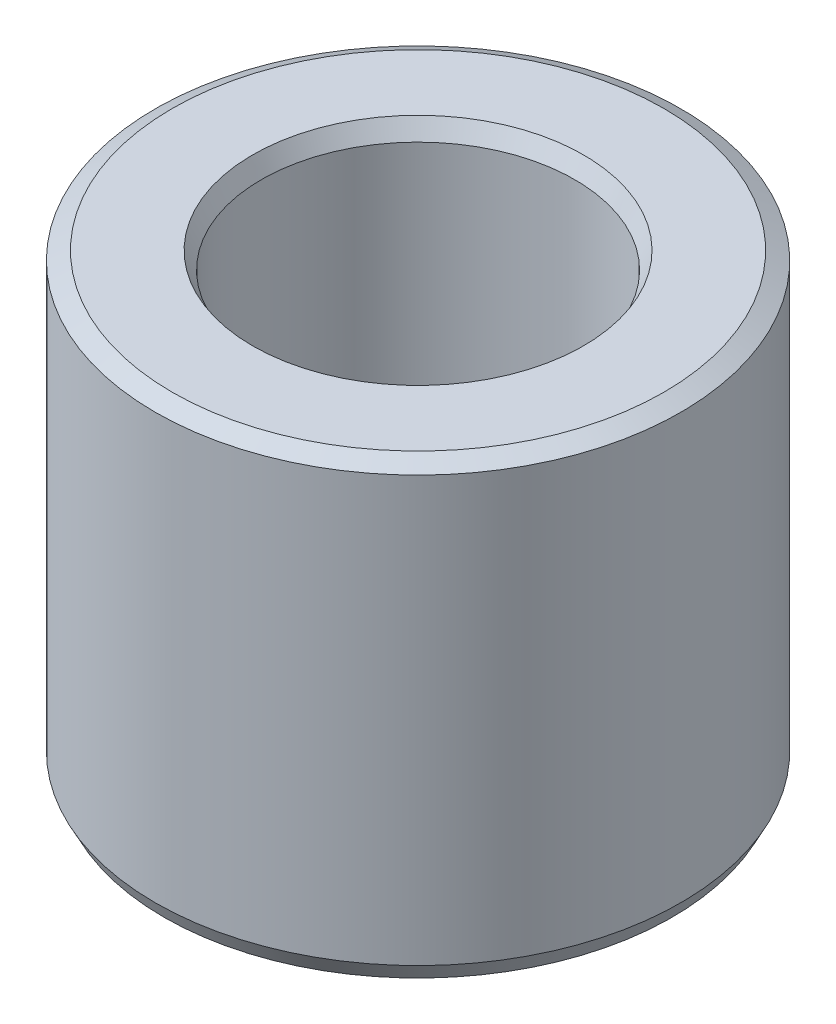
ISO-10303-21;
HEADER;
FILE_DESCRIPTION(('STEP AP214'),'2;1');
FILE_NAME('part.step','',(''),(''),'','','');
FILE_SCHEMA(('AUTOMOTIVE_DESIGN { 1 0 10303 214 1 1 1 1 }'));
ENDSEC;
DATA;
#1=APPLICATION_CONTEXT('core data for automotive mechanical design processes');
#2=APPLICATION_PROTOCOL_DEFINITION('international standard','automotive_design',2000,#1);
#3=PRODUCT_CONTEXT('',#1,'mechanical');
#4=PRODUCT('Part','Part','',(#3));
#5=PRODUCT_RELATED_PRODUCT_CATEGORY('part','',(#4));
#6=PRODUCT_DEFINITION_FORMATION('','',#4);
#7=PRODUCT_DEFINITION_CONTEXT('part definition',#1,'design');
#8=PRODUCT_DEFINITION('design','',#6,#7);
#9=PRODUCT_DEFINITION_SHAPE('','',#8);
#10=(LENGTH_UNIT() NAMED_UNIT(*) SI_UNIT(.MILLI.,.METRE.));
#11=(NAMED_UNIT(*) PLANE_ANGLE_UNIT() SI_UNIT($,.RADIAN.));
#12=(NAMED_UNIT(*) SI_UNIT($,.STERADIAN.) SOLID_ANGLE_UNIT());
#13=UNCERTAINTY_MEASURE_WITH_UNIT(LENGTH_MEASURE(1.E-05),#10,'distance_accuracy_value','');
#14=(GEOMETRIC_REPRESENTATION_CONTEXT(3) GLOBAL_UNCERTAINTY_ASSIGNED_CONTEXT((#13)) GLOBAL_UNIT_ASSIGNED_CONTEXT((#10,
#11,#12)) REPRESENTATION_CONTEXT('',''));
#15=CARTESIAN_POINT('',(0.,0.,0.));
#16=DIRECTION('',(0.,0.,1.));
#17=DIRECTION('',(1.,0.,0.));
#18=AXIS2_PLACEMENT_3D('',#15,#16,#17);
#19=CARTESIAN_POINT('',(0.,68.5759343217191,0.));
#20=DIRECTION('',(0.,-1.,0.));
#21=DIRECTION('',(0.,0.,-1.));
#22=AXIS2_PLACEMENT_3D('',#19,#20,#21);
#23=CYLINDRICAL_SURFACE('',#22,40.);
#24=CARTESIAN_POINT('',(0.,2.59032202311171,0.));
#25=DIRECTION('',(0.,1.,0.));
#26=DIRECTION('',(0.,0.,1.));
#27=AXIS2_PLACEMENT_3D('',#24,#25,#26);
#28=CIRCLE('',#27,40.);
#29=CARTESIAN_POINT('',(0.,2.59032202311171,40.));
#30=VERTEX_POINT('',#29);
#31=EDGE_CURVE('E10',#30,#30,#28,.T.);
#32=ORIENTED_EDGE('',*,*,#31,.T.);
#33=EDGE_LOOP('',(#32));
#34=FACE_BOUND('',#33,.T.);
#35=CARTESIAN_POINT('',(0.,67.2370375964509,0.));
#36=DIRECTION('',(0.,1.,0.));
#37=DIRECTION('',(0.,0.,1.));
#38=AXIS2_PLACEMENT_3D('',#35,#36,#37);
#39=CIRCLE('',#38,40.);
#40=CARTESIAN_POINT('',(0.,67.2370375964509,40.));
#41=VERTEX_POINT('',#40);
#42=EDGE_CURVE('E50',#41,#41,#39,.F.);
#43=ORIENTED_EDGE('',*,*,#42,.T.);
#44=EDGE_LOOP('',(#43));
#45=FACE_BOUND('',#44,.T.);
#46=ADVANCED_FACE('F39',(#34,#45),#23,.T.);
#47=CARTESIAN_POINT('',(0.,68.5759343217191,0.));
#48=DIRECTION('',(0.,1.,0.));
#49=DIRECTION('',(0.,0.,1.));
#50=AXIS2_PLACEMENT_3D('',#47,#48,#49);
#51=PLANE('',#50);
#52=CARTESIAN_POINT('',(0.,68.5759343217191,0.));
#53=DIRECTION('',(0.,1.,0.));
#54=DIRECTION('',(0.,0.,1.));
#55=AXIS2_PLACEMENT_3D('',#52,#53,#54);
#56=CIRCLE('',#55,25.181578989234);
#57=CARTESIAN_POINT('',(0.,68.5759343217191,25.181578989234));
#58=VERTEX_POINT('',#57);
#59=EDGE_CURVE('E58',#58,#58,#56,.F.);
#60=ORIENTED_EDGE('',*,*,#59,.T.);
#61=EDGE_LOOP('',(#60));
#62=FACE_BOUND('',#61,.T.);
#63=CARTESIAN_POINT('',(0.,68.5759343217191,0.));
#64=DIRECTION('',(0.,1.,0.));
#65=DIRECTION('',(0.,0.,1.));
#66=AXIS2_PLACEMENT_3D('',#63,#64,#65);
#67=CIRCLE('',#66,37.4096779768884);
#68=CARTESIAN_POINT('',(0.,68.5759343217191,37.4096779768884));
#69=VERTEX_POINT('',#68);
#70=EDGE_CURVE('E61',#69,#69,#67,.T.);
#71=ORIENTED_EDGE('',*,*,#70,.T.);
#72=EDGE_LOOP('',(#71));
#73=FACE_BOUND('',#72,.T.);
#74=ADVANCED_FACE('F88',(#62,#73),#51,.T.);
#75=CARTESIAN_POINT('',(0.,0.,0.));
#76=DIRECTION('',(0.,1.,0.));
#77=DIRECTION('',(0.,0.,1.));
#78=AXIS2_PLACEMENT_3D('',#75,#76,#77);
#79=PLANE('',#78);
#80=CARTESIAN_POINT('',(0.,0.,0.));
#81=DIRECTION('',(0.,1.,0.));
#82=DIRECTION('',(0.,0.,1.));
#83=AXIS2_PLACEMENT_3D('',#80,#81,#82);
#84=CIRCLE('',#83,26.4330042870776);
#85=CARTESIAN_POINT('',(0.,0.,26.4330042870776));
#86=VERTEX_POINT('',#85);
#87=EDGE_CURVE('E51',#86,#86,#84,.T.);
#88=ORIENTED_EDGE('',*,*,#87,.T.);
#89=EDGE_LOOP('',(#88));
#90=FACE_BOUND('',#89,.T.);
#91=CARTESIAN_POINT('',(0.,0.,0.));
#92=DIRECTION('',(0.,1.,0.));
#93=DIRECTION('',(0.,0.,1.));
#94=AXIS2_PLACEMENT_3D('',#91,#92,#93);
#95=CIRCLE('',#94,38.6611032747319);
#96=CARTESIAN_POINT('',(0.,0.,38.6611032747319));
#97=VERTEX_POINT('',#96);
#98=EDGE_CURVE('E54',#97,#97,#95,.F.);
#99=ORIENTED_EDGE('',*,*,#98,.T.);
#100=EDGE_LOOP('',(#99));
#101=FACE_BOUND('',#100,.T.);
#102=ADVANCED_FACE('F83',(#90,#101),#79,.F.);
#103=CARTESIAN_POINT('',(0.,68.5759343217191,0.));
#104=DIRECTION('',(0.,-1.,0.));
#105=DIRECTION('',(0.,0.,-1.));
#106=AXIS2_PLACEMENT_3D('',#103,#104,#105);
#107=CYLINDRICAL_SURFACE('',#106,23.8426822639659);
#108=CARTESIAN_POINT('',(0.,65.9856122986074,0.));
#109=DIRECTION('',(0.,1.,0.));
#110=DIRECTION('',(0.,0.,1.));
#111=AXIS2_PLACEMENT_3D('',#108,#109,#110);
#112=CIRCLE('',#111,23.8426822639659);
#113=CARTESIAN_POINT('',(0.,65.9856122986074,23.8426822639659));
#114=VERTEX_POINT('',#113);
#115=EDGE_CURVE('E67',#114,#114,#112,.T.);
#116=ORIENTED_EDGE('',*,*,#115,.T.);
#117=EDGE_LOOP('',(#116));
#118=FACE_BOUND('',#117,.T.);
#119=CARTESIAN_POINT('',(0.,1.33889672526813,0.));
#120=DIRECTION('',(0.,1.,0.));
#121=DIRECTION('',(0.,0.,1.));
#122=AXIS2_PLACEMENT_3D('',#119,#120,#121);
#123=CIRCLE('',#122,23.8426822639659);
#124=CARTESIAN_POINT('',(0.,1.33889672526813,23.8426822639659));
#125=VERTEX_POINT('',#124);
#126=EDGE_CURVE('E69',#125,#125,#123,.F.);
#127=ORIENTED_EDGE('',*,*,#126,.T.);
#128=EDGE_LOOP('',(#127));
#129=FACE_BOUND('',#128,.T.);
#130=ADVANCED_FACE('F71',(#118,#129),#107,.F.);
#131=CARTESIAN_POINT('',(0.,65.9856122986074,0.));
#132=DIRECTION('',(0.,1.,0.));
#133=DIRECTION('',(0.,0.,1.));
#134=AXIS2_PLACEMENT_3D('',#131,#132,#133);
#135=CONICAL_SURFACE('',#134,23.8426822639659,0.477063612130206);
#136=ORIENTED_EDGE('',*,*,#59,.F.);
#137=EDGE_LOOP('',(#136));
#138=FACE_BOUND('',#137,.T.);
#139=ORIENTED_EDGE('',*,*,#115,.F.);
#140=EDGE_LOOP('',(#139));
#141=FACE_BOUND('',#140,.T.);
#142=ADVANCED_FACE('F77',(#138,#141),#135,.F.);
#143=CARTESIAN_POINT('',(0.,0.,0.));
#144=DIRECTION('',(0.,-1.,0.));
#145=DIRECTION('',(0.,0.,-1.));
#146=AXIS2_PLACEMENT_3D('',#143,#144,#145);
#147=CONICAL_SURFACE('',#146,26.4330042870776,1.09373271466469);
#148=ORIENTED_EDGE('',*,*,#126,.F.);
#149=EDGE_LOOP('',(#148));
#150=FACE_BOUND('',#149,.T.);
#151=ORIENTED_EDGE('',*,*,#87,.F.);
#152=EDGE_LOOP('',(#151));
#153=FACE_BOUND('',#152,.T.);
#154=ADVANCED_FACE('F73',(#150,#153),#147,.F.);
#155=CARTESIAN_POINT('',(0.,2.59032202311171,0.));
#156=DIRECTION('',(0.,1.,0.));
#157=DIRECTION('',(0.,0.,1.));
#158=AXIS2_PLACEMENT_3D('',#155,#156,#157);
#159=CONICAL_SURFACE('',#158,40.,0.477063612130211);
#160=ORIENTED_EDGE('',*,*,#98,.F.);
#161=EDGE_LOOP('',(#160));
#162=FACE_BOUND('',#161,.T.);
#163=ORIENTED_EDGE('',*,*,#31,.F.);
#164=EDGE_LOOP('',(#163));
#165=FACE_BOUND('',#164,.T.);
#166=ADVANCED_FACE('F76',(#162,#165),#159,.T.);
#167=CARTESIAN_POINT('',(0.,68.5759343217191,0.));
#168=DIRECTION('',(0.,-1.,0.));
#169=DIRECTION('',(0.,0.,-1.));
#170=AXIS2_PLACEMENT_3D('',#167,#168,#169);
#171=CONICAL_SURFACE('',#170,37.4096779768884,1.09373271466468);
#172=ORIENTED_EDGE('',*,*,#42,.F.);
#173=EDGE_LOOP('',(#172));
#174=FACE_BOUND('',#173,.T.);
#175=ORIENTED_EDGE('',*,*,#70,.F.);
#176=EDGE_LOOP('',(#175));
#177=FACE_BOUND('',#176,.T.);
#178=ADVANCED_FACE('F45',(#174,#177),#171,.T.);
#179=CLOSED_SHELL('',(#46,#74,#102,#130,#142,#154,#166,#178));
#180=MANIFOLD_SOLID_BREP('B2',#179);
#181=ADVANCED_BREP_SHAPE_REPRESENTATION('',(#18,#180),#14);
#182=SHAPE_DEFINITION_REPRESENTATION(#9,#181);
ENDSEC;
END-ISO-10303-21;
